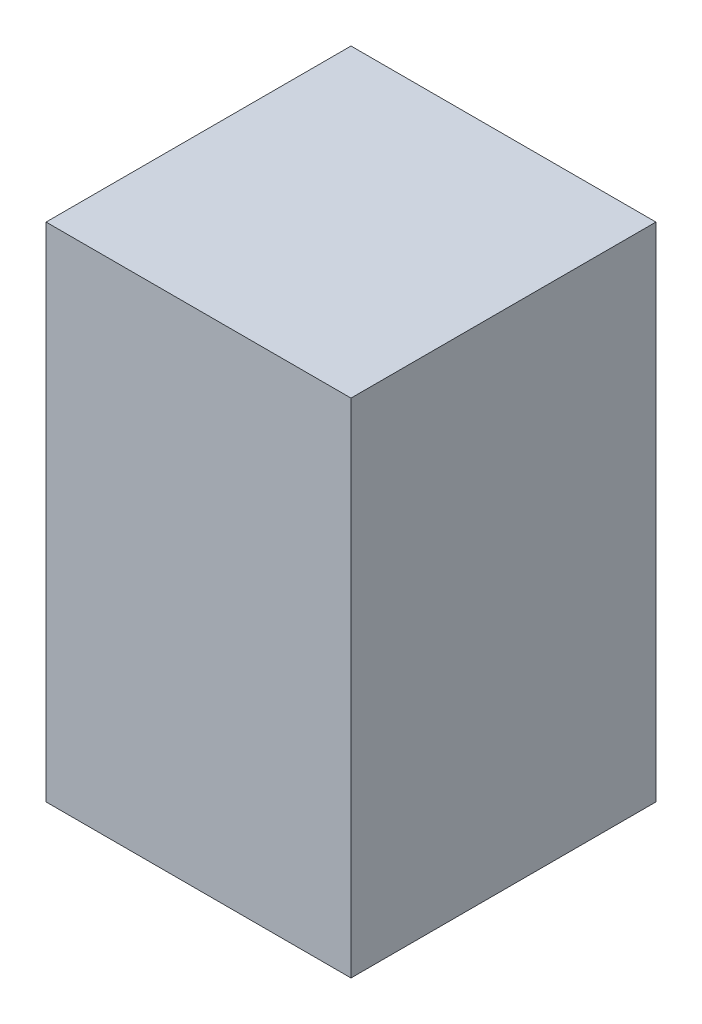
ISO-10303-21;
HEADER;
FILE_DESCRIPTION(('STEP AP214'),'2;1');
FILE_NAME('part.step','',(''),(''),'','','');
FILE_SCHEMA(('AUTOMOTIVE_DESIGN { 1 0 10303 214 1 1 1 1 }'));
ENDSEC;
DATA;
#1=APPLICATION_CONTEXT('core data for automotive mechanical design processes');
#2=APPLICATION_PROTOCOL_DEFINITION('international standard','automotive_design',2000,#1);
#3=PRODUCT_CONTEXT('',#1,'mechanical');
#4=PRODUCT('Part','Part','',(#3));
#5=PRODUCT_RELATED_PRODUCT_CATEGORY('part','',(#4));
#6=PRODUCT_DEFINITION_FORMATION('','',#4);
#7=PRODUCT_DEFINITION_CONTEXT('part definition',#1,'design');
#8=PRODUCT_DEFINITION('design','',#6,#7);
#9=PRODUCT_DEFINITION_SHAPE('','',#8);
#10=(LENGTH_UNIT() NAMED_UNIT(*) SI_UNIT(.MILLI.,.METRE.));
#11=(NAMED_UNIT(*) PLANE_ANGLE_UNIT() SI_UNIT($,.RADIAN.));
#12=(NAMED_UNIT(*) SI_UNIT($,.STERADIAN.) SOLID_ANGLE_UNIT());
#13=UNCERTAINTY_MEASURE_WITH_UNIT(LENGTH_MEASURE(1.E-05),#10,'distance_accuracy_value','');
#14=(GEOMETRIC_REPRESENTATION_CONTEXT(3) GLOBAL_UNCERTAINTY_ASSIGNED_CONTEXT((#13)) GLOBAL_UNIT_ASSIGNED_CONTEXT((#10,
#11,#12)) REPRESENTATION_CONTEXT('',''));
#15=CARTESIAN_POINT('',(0.,0.,0.));
#16=DIRECTION('',(0.,0.,1.));
#17=DIRECTION('',(1.,0.,0.));
#18=AXIS2_PLACEMENT_3D('',#15,#16,#17);
#19=CARTESIAN_POINT('',(0.,142.24,0.));
#20=DIRECTION('',(1.,0.,0.));
#21=DIRECTION('',(0.,0.,-1.));
#22=AXIS2_PLACEMENT_3D('',#19,#20,#21);
#23=PLANE('',#22);
#24=DIRECTION('',(0.,0.,1.));
#25=VECTOR('',#24,1.);
#26=CARTESIAN_POINT('',(0.,0.,0.));
#27=LINE('',#26,#25);
#28=CARTESIAN_POINT('',(0.,0.,-86.36));
#29=VERTEX_POINT('',#28);
#30=CARTESIAN_POINT('',(0.,0.,0.));
#31=VERTEX_POINT('',#30);
#32=EDGE_CURVE('E75',#29,#31,#27,.T.);
#33=ORIENTED_EDGE('',*,*,#32,.T.);
#34=DIRECTION('',(0.,-1.,0.));
#35=VECTOR('',#34,1.);
#36=CARTESIAN_POINT('',(0.,142.24,0.));
#37=LINE('',#36,#35);
#38=CARTESIAN_POINT('',(0.,142.24,0.));
#39=VERTEX_POINT('',#38);
#40=EDGE_CURVE('E11',#39,#31,#37,.T.);
#41=ORIENTED_EDGE('',*,*,#40,.F.);
#42=DIRECTION('',(0.,0.,1.));
#43=VECTOR('',#42,1.);
#44=CARTESIAN_POINT('',(0.,142.24,0.));
#45=LINE('',#44,#43);
#46=CARTESIAN_POINT('',(0.,142.24,-86.36));
#47=VERTEX_POINT('',#46);
#48=EDGE_CURVE('E93',#47,#39,#45,.T.);
#49=ORIENTED_EDGE('',*,*,#48,.F.);
#50=DIRECTION('',(0.,-1.,0.));
#51=VECTOR('',#50,1.);
#52=CARTESIAN_POINT('',(0.,142.24,-86.36));
#53=LINE('',#52,#51);
#54=EDGE_CURVE('E87',#47,#29,#53,.T.);
#55=ORIENTED_EDGE('',*,*,#54,.T.);
#56=EDGE_LOOP('',(#33,#41,#49,#55));
#57=FACE_BOUND('',#56,.T.);
#58=ADVANCED_FACE('F31',(#57),#23,.F.);
#59=CARTESIAN_POINT('',(0.,142.24,0.));
#60=DIRECTION('',(0.,0.,-1.));
#61=DIRECTION('',(-1.,0.,0.));
#62=AXIS2_PLACEMENT_3D('',#59,#60,#61);
#63=PLANE('',#62);
#64=DIRECTION('',(1.,0.,0.));
#65=VECTOR('',#64,1.);
#66=CARTESIAN_POINT('',(0.,0.,0.));
#67=LINE('',#66,#65);
#68=CARTESIAN_POINT('',(86.36,0.,0.));
#69=VERTEX_POINT('',#68);
#70=EDGE_CURVE('E71',#31,#69,#67,.T.);
#71=ORIENTED_EDGE('',*,*,#70,.T.);
#72=DIRECTION('',(0.,-1.,0.));
#73=VECTOR('',#72,1.);
#74=CARTESIAN_POINT('',(86.36,142.24,0.));
#75=LINE('',#74,#73);
#76=CARTESIAN_POINT('',(86.36,142.24,0.));
#77=VERTEX_POINT('',#76);
#78=EDGE_CURVE('E38',#77,#69,#75,.T.);
#79=ORIENTED_EDGE('',*,*,#78,.F.);
#80=DIRECTION('',(1.,0.,0.));
#81=VECTOR('',#80,1.);
#82=CARTESIAN_POINT('',(0.,142.24,0.));
#83=LINE('',#82,#81);
#84=EDGE_CURVE('E83',#39,#77,#83,.T.);
#85=ORIENTED_EDGE('',*,*,#84,.F.);
#86=ORIENTED_EDGE('',*,*,#40,.T.);
#87=EDGE_LOOP('',(#71,#79,#85,#86));
#88=FACE_BOUND('',#87,.T.);
#89=ADVANCED_FACE('F82',(#88),#63,.F.);
#90=CARTESIAN_POINT('',(86.36,142.24,0.));
#91=DIRECTION('',(-1.,0.,0.));
#92=DIRECTION('',(0.,0.,1.));
#93=AXIS2_PLACEMENT_3D('',#90,#91,#92);
#94=PLANE('',#93);
#95=DIRECTION('',(0.,0.,-1.));
#96=VECTOR('',#95,1.);
#97=CARTESIAN_POINT('',(86.36,0.,0.));
#98=LINE('',#97,#96);
#99=CARTESIAN_POINT('',(86.36,0.,-86.36));
#100=VERTEX_POINT('',#99);
#101=EDGE_CURVE('E76',#69,#100,#98,.T.);
#102=ORIENTED_EDGE('',*,*,#101,.T.);
#103=DIRECTION('',(0.,-1.,0.));
#104=VECTOR('',#103,1.);
#105=CARTESIAN_POINT('',(86.36,142.24,-86.36));
#106=LINE('',#105,#104);
#107=CARTESIAN_POINT('',(86.36,142.24,-86.36));
#108=VERTEX_POINT('',#107);
#109=EDGE_CURVE('E99',#108,#100,#106,.T.);
#110=ORIENTED_EDGE('',*,*,#109,.F.);
#111=DIRECTION('',(0.,0.,-1.));
#112=VECTOR('',#111,1.);
#113=CARTESIAN_POINT('',(86.36,142.24,0.));
#114=LINE('',#113,#112);
#115=EDGE_CURVE('E50',#77,#108,#114,.T.);
#116=ORIENTED_EDGE('',*,*,#115,.F.);
#117=ORIENTED_EDGE('',*,*,#78,.T.);
#118=EDGE_LOOP('',(#102,#110,#116,#117));
#119=FACE_BOUND('',#118,.T.);
#120=ADVANCED_FACE('F102',(#119),#94,.F.);
#121=CARTESIAN_POINT('',(0.,142.24,-86.36));
#122=DIRECTION('',(0.,0.,1.));
#123=DIRECTION('',(1.,0.,0.));
#124=AXIS2_PLACEMENT_3D('',#121,#122,#123);
#125=PLANE('',#124);
#126=DIRECTION('',(-1.,0.,0.));
#127=VECTOR('',#126,1.);
#128=CARTESIAN_POINT('',(0.,0.,-86.36));
#129=LINE('',#128,#127);
#130=EDGE_CURVE('E91',#100,#29,#129,.T.);
#131=ORIENTED_EDGE('',*,*,#130,.T.);
#132=ORIENTED_EDGE('',*,*,#54,.F.);
#133=DIRECTION('',(-1.,0.,0.));
#134=VECTOR('',#133,1.);
#135=CARTESIAN_POINT('',(0.,142.24,-86.36));
#136=LINE('',#135,#134);
#137=EDGE_CURVE('E45',#108,#47,#136,.T.);
#138=ORIENTED_EDGE('',*,*,#137,.F.);
#139=ORIENTED_EDGE('',*,*,#109,.T.);
#140=EDGE_LOOP('',(#131,#132,#138,#139));
#141=FACE_BOUND('',#140,.T.);
#142=ADVANCED_FACE('F104',(#141),#125,.F.);
#143=CARTESIAN_POINT('',(0.,142.24,-86.36));
#144=DIRECTION('',(0.,-1.,0.));
#145=DIRECTION('',(0.,0.,-1.));
#146=AXIS2_PLACEMENT_3D('',#143,#144,#145);
#147=PLANE('',#146);
#148=ORIENTED_EDGE('',*,*,#48,.T.);
#149=ORIENTED_EDGE('',*,*,#84,.T.);
#150=ORIENTED_EDGE('',*,*,#115,.T.);
#151=ORIENTED_EDGE('',*,*,#137,.T.);
#152=EDGE_LOOP('',(#148,#149,#150,#151));
#153=FACE_BOUND('',#152,.T.);
#154=ADVANCED_FACE('F105',(#153),#147,.F.);
#155=CARTESIAN_POINT('',(0.,0.,-86.36));
#156=DIRECTION('',(0.,-1.,0.));
#157=DIRECTION('',(0.,0.,-1.));
#158=AXIS2_PLACEMENT_3D('',#155,#156,#157);
#159=PLANE('',#158);
#160=ORIENTED_EDGE('',*,*,#32,.F.);
#161=ORIENTED_EDGE('',*,*,#130,.F.);
#162=ORIENTED_EDGE('',*,*,#101,.F.);
#163=ORIENTED_EDGE('',*,*,#70,.F.);
#164=EDGE_LOOP('',(#160,#161,#162,#163));
#165=FACE_BOUND('',#164,.T.);
#166=ADVANCED_FACE('F72',(#165),#159,.T.);
#167=CLOSED_SHELL('',(#58,#89,#120,#142,#154,#166));
#168=MANIFOLD_SOLID_BREP('B2',#167);
#169=ADVANCED_BREP_SHAPE_REPRESENTATION('',(#18,#168),#14);
#170=SHAPE_DEFINITION_REPRESENTATION(#9,#169);
ENDSEC;
END-ISO-10303-21;
